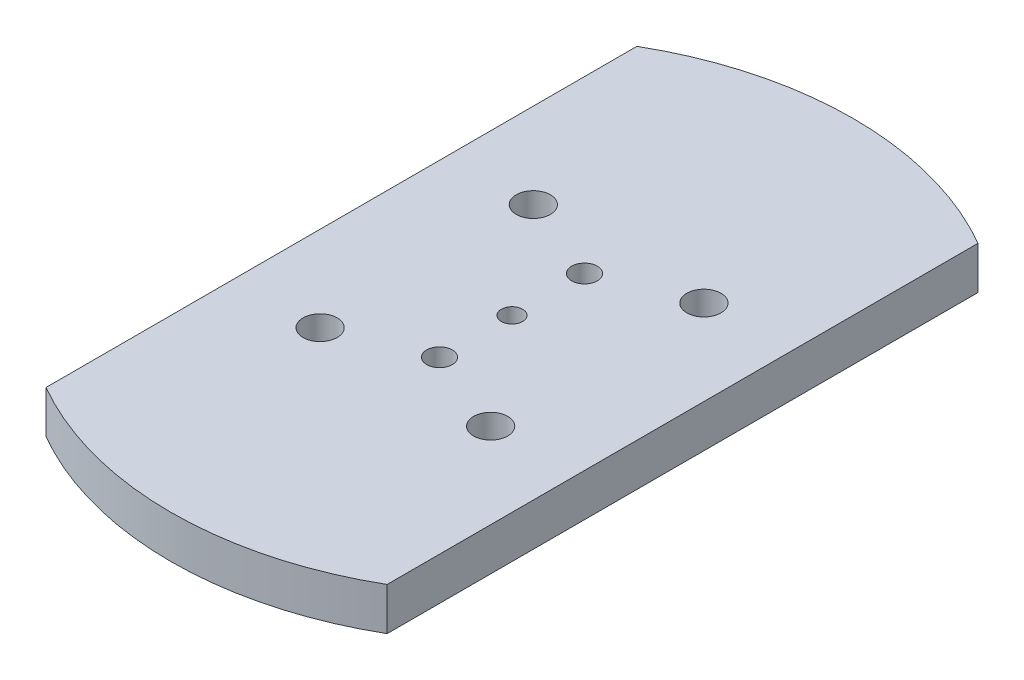
ISO-10303-21;
HEADER;
FILE_DESCRIPTION(('STEP AP214'),'2;1');
FILE_NAME('part.step','',(''),(''),'','','');
FILE_SCHEMA(('AUTOMOTIVE_DESIGN { 1 0 10303 214 1 1 1 1 }'));
ENDSEC;
DATA;
#1=APPLICATION_CONTEXT('core data for automotive mechanical design processes');
#2=APPLICATION_PROTOCOL_DEFINITION('international standard','automotive_design',2000,#1);
#3=PRODUCT_CONTEXT('',#1,'mechanical');
#4=PRODUCT('Part','Part','',(#3));
#5=PRODUCT_RELATED_PRODUCT_CATEGORY('part','',(#4));
#6=PRODUCT_DEFINITION_FORMATION('','',#4);
#7=PRODUCT_DEFINITION_CONTEXT('part definition',#1,'design');
#8=PRODUCT_DEFINITION('design','',#6,#7);
#9=PRODUCT_DEFINITION_SHAPE('','',#8);
#10=(LENGTH_UNIT() NAMED_UNIT(*) SI_UNIT(.MILLI.,.METRE.));
#11=(NAMED_UNIT(*) PLANE_ANGLE_UNIT() SI_UNIT($,.RADIAN.));
#12=(NAMED_UNIT(*) SI_UNIT($,.STERADIAN.) SOLID_ANGLE_UNIT());
#13=UNCERTAINTY_MEASURE_WITH_UNIT(LENGTH_MEASURE(1.E-05),#10,'distance_accuracy_value','');
#14=(GEOMETRIC_REPRESENTATION_CONTEXT(3) GLOBAL_UNCERTAINTY_ASSIGNED_CONTEXT((#13)) GLOBAL_UNIT_ASSIGNED_CONTEXT((#10,
#11,#12)) REPRESENTATION_CONTEXT('',''));
#15=CARTESIAN_POINT('',(0.,0.,0.));
#16=DIRECTION('',(0.,0.,1.));
#17=DIRECTION('',(1.,0.,0.));
#18=AXIS2_PLACEMENT_3D('',#15,#16,#17);
#19=CARTESIAN_POINT('',(0.,5.,0.));
#20=DIRECTION('',(0.,1.,0.));
#21=DIRECTION('',(0.,0.,1.));
#22=AXIS2_PLACEMENT_3D('',#19,#20,#21);
#23=PLANE('',#22);
#24=CARTESIAN_POINT('',(0.,5.,0.));
#25=DIRECTION('',(0.,1.,0.));
#26=DIRECTION('',(0.,0.,1.));
#27=AXIS2_PLACEMENT_3D('',#24,#25,#26);
#28=CIRCLE('',#27,1.25);
#29=CARTESIAN_POINT('',(0.,5.,1.25));
#30=VERTEX_POINT('',#29);
#31=EDGE_CURVE('E143',#30,#30,#28,.T.);
#32=ORIENTED_EDGE('',*,*,#31,.F.);
#33=EDGE_LOOP('',(#32));
#34=FACE_BOUND('',#33,.T.);
#35=CARTESIAN_POINT('',(10.,5.,-12.5));
#36=DIRECTION('',(0.,-1.,0.));
#37=DIRECTION('',(0.,0.,1.));
#38=AXIS2_PLACEMENT_3D('',#35,#36,#37);
#39=CIRCLE('',#38,2.);
#40=CARTESIAN_POINT('',(10.,5.,-10.5));
#41=VERTEX_POINT('',#40);
#42=EDGE_CURVE('E126',#41,#41,#39,.T.);
#43=ORIENTED_EDGE('',*,*,#42,.T.);
#44=EDGE_LOOP('',(#43));
#45=FACE_BOUND('',#44,.T.);
#46=CARTESIAN_POINT('',(-10.,5.,-12.5));
#47=DIRECTION('',(0.,1.,0.));
#48=DIRECTION('',(0.,0.,1.));
#49=AXIS2_PLACEMENT_3D('',#46,#47,#48);
#50=CIRCLE('',#49,2.);
#51=CARTESIAN_POINT('',(-10.,5.,-10.5));
#52=VERTEX_POINT('',#51);
#53=EDGE_CURVE('E119',#52,#52,#50,.T.);
#54=ORIENTED_EDGE('',*,*,#53,.F.);
#55=EDGE_LOOP('',(#54));
#56=FACE_BOUND('',#55,.T.);
#57=CARTESIAN_POINT('',(0.,5.,8.5));
#58=DIRECTION('',(0.,1.,0.));
#59=DIRECTION('',(0.,0.,1.));
#60=AXIS2_PLACEMENT_3D('',#57,#58,#59);
#61=CIRCLE('',#60,1.5);
#62=CARTESIAN_POINT('',(0.,5.,10.));
#63=VERTEX_POINT('',#62);
#64=EDGE_CURVE('E109',#63,#63,#61,.T.);
#65=ORIENTED_EDGE('',*,*,#64,.F.);
#66=EDGE_LOOP('',(#65));
#67=FACE_BOUND('',#66,.T.);
#68=CARTESIAN_POINT('',(0.,5.,-8.5));
#69=DIRECTION('',(0.,1.,0.));
#70=DIRECTION('',(0.,0.,1.));
#71=AXIS2_PLACEMENT_3D('',#68,#69,#70);
#72=CIRCLE('',#71,1.5);
#73=CARTESIAN_POINT('',(0.,5.,-7.));
#74=VERTEX_POINT('',#73);
#75=EDGE_CURVE('E103',#74,#74,#72,.T.);
#76=ORIENTED_EDGE('',*,*,#75,.F.);
#77=EDGE_LOOP('',(#76));
#78=FACE_BOUND('',#77,.T.);
#79=DIRECTION('',(0.,0.,-1.));
#80=VECTOR('',#79,1.);
#81=CARTESIAN_POINT('',(20.,5.,-40.));
#82=LINE('',#81,#80);
#83=CARTESIAN_POINT('',(20.,5.,34.6410161513775));
#84=VERTEX_POINT('',#83);
#85=CARTESIAN_POINT('',(20.,5.,-34.6410161513776));
#86=VERTEX_POINT('',#85);
#87=EDGE_CURVE('E95',#84,#86,#82,.T.);
#88=ORIENTED_EDGE('',*,*,#87,.T.);
#89=CARTESIAN_POINT('',(0.,5.,0.));
#90=DIRECTION('',(0.,1.,0.));
#91=DIRECTION('',(0.,0.,1.));
#92=AXIS2_PLACEMENT_3D('',#89,#90,#91);
#93=CIRCLE('',#92,40.);
#94=CARTESIAN_POINT('',(-20.,5.,-34.6410161513775));
#95=VERTEX_POINT('',#94);
#96=EDGE_CURVE('E57',#86,#95,#93,.T.);
#97=ORIENTED_EDGE('',*,*,#96,.T.);
#98=DIRECTION('',(0.,0.,1.));
#99=VECTOR('',#98,1.);
#100=CARTESIAN_POINT('',(-20.,5.,-40.));
#101=LINE('',#100,#99);
#102=CARTESIAN_POINT('',(-20.,5.,34.6410161513775));
#103=VERTEX_POINT('',#102);
#104=EDGE_CURVE('E92',#95,#103,#101,.T.);
#105=ORIENTED_EDGE('',*,*,#104,.T.);
#106=EDGE_CURVE('E117',#103,#84,#93,.T.);
#107=ORIENTED_EDGE('',*,*,#106,.T.);
#108=EDGE_LOOP('',(#88,#97,#105,#107));
#109=FACE_BOUND('',#108,.T.);
#110=CARTESIAN_POINT('',(10.,5.,12.5));
#111=DIRECTION('',(0.,1.,0.));
#112=DIRECTION('',(0.,0.,-1.));
#113=AXIS2_PLACEMENT_3D('',#110,#111,#112);
#114=CIRCLE('',#113,2.);
#115=CARTESIAN_POINT('',(10.,5.,10.5));
#116=VERTEX_POINT('',#115);
#117=EDGE_CURVE('E132',#116,#116,#114,.T.);
#118=ORIENTED_EDGE('',*,*,#117,.F.);
#119=EDGE_LOOP('',(#118));
#120=FACE_BOUND('',#119,.T.);
#121=CARTESIAN_POINT('',(-10.,5.,12.5));
#122=DIRECTION('',(0.,-1.,0.));
#123=DIRECTION('',(0.,0.,-1.));
#124=AXIS2_PLACEMENT_3D('',#121,#122,#123);
#125=CIRCLE('',#124,2.);
#126=CARTESIAN_POINT('',(-10.,5.,10.5));
#127=VERTEX_POINT('',#126);
#128=EDGE_CURVE('E138',#127,#127,#125,.T.);
#129=ORIENTED_EDGE('',*,*,#128,.T.);
#130=EDGE_LOOP('',(#129));
#131=FACE_BOUND('',#130,.T.);
#132=ADVANCED_FACE('F33',(#34,#45,#56,#67,#78,#109,#120,#131),#23,.T.);
#133=CARTESIAN_POINT('',(0.,0.,0.));
#134=DIRECTION('',(0.,1.,0.));
#135=DIRECTION('',(0.,0.,1.));
#136=AXIS2_PLACEMENT_3D('',#133,#134,#135);
#137=PLANE('',#136);
#138=CARTESIAN_POINT('',(0.,0.,0.));
#139=DIRECTION('',(0.,1.,0.));
#140=DIRECTION('',(0.,0.,1.));
#141=AXIS2_PLACEMENT_3D('',#138,#139,#140);
#142=CIRCLE('',#141,1.25);
#143=CARTESIAN_POINT('',(0.,0.,1.25));
#144=VERTEX_POINT('',#143);
#145=EDGE_CURVE('E37',#144,#144,#142,.T.);
#146=ORIENTED_EDGE('',*,*,#145,.T.);
#147=EDGE_LOOP('',(#146));
#148=FACE_BOUND('',#147,.T.);
#149=CARTESIAN_POINT('',(10.,0.,-12.5));
#150=DIRECTION('',(0.,-1.,0.));
#151=DIRECTION('',(0.,0.,1.));
#152=AXIS2_PLACEMENT_3D('',#149,#150,#151);
#153=CIRCLE('',#152,2.);
#154=CARTESIAN_POINT('',(10.,0.,-10.5));
#155=VERTEX_POINT('',#154);
#156=EDGE_CURVE('E123',#155,#155,#153,.T.);
#157=ORIENTED_EDGE('',*,*,#156,.F.);
#158=EDGE_LOOP('',(#157));
#159=FACE_BOUND('',#158,.T.);
#160=CARTESIAN_POINT('',(-10.,0.,-12.5));
#161=DIRECTION('',(0.,1.,0.));
#162=DIRECTION('',(0.,0.,1.));
#163=AXIS2_PLACEMENT_3D('',#160,#161,#162);
#164=CIRCLE('',#163,2.);
#165=CARTESIAN_POINT('',(-10.,0.,-10.5));
#166=VERTEX_POINT('',#165);
#167=EDGE_CURVE('E122',#166,#166,#164,.T.);
#168=ORIENTED_EDGE('',*,*,#167,.T.);
#169=EDGE_LOOP('',(#168));
#170=FACE_BOUND('',#169,.T.);
#171=CARTESIAN_POINT('',(0.,0.,8.5));
#172=DIRECTION('',(0.,1.,0.));
#173=DIRECTION('',(0.,0.,1.));
#174=AXIS2_PLACEMENT_3D('',#171,#172,#173);
#175=CIRCLE('',#174,1.5);
#176=CARTESIAN_POINT('',(0.,0.,10.));
#177=VERTEX_POINT('',#176);
#178=EDGE_CURVE('E106',#177,#177,#175,.T.);
#179=ORIENTED_EDGE('',*,*,#178,.T.);
#180=EDGE_LOOP('',(#179));
#181=FACE_BOUND('',#180,.T.);
#182=CARTESIAN_POINT('',(0.,0.,-8.5));
#183=DIRECTION('',(0.,1.,0.));
#184=DIRECTION('',(0.,0.,1.));
#185=AXIS2_PLACEMENT_3D('',#182,#183,#184);
#186=CIRCLE('',#185,1.5);
#187=CARTESIAN_POINT('',(0.,0.,-7.));
#188=VERTEX_POINT('',#187);
#189=EDGE_CURVE('E97',#188,#188,#186,.T.);
#190=ORIENTED_EDGE('',*,*,#189,.T.);
#191=EDGE_LOOP('',(#190));
#192=FACE_BOUND('',#191,.T.);
#193=CARTESIAN_POINT('',(0.,0.,0.));
#194=DIRECTION('',(0.,1.,0.));
#195=DIRECTION('',(0.,0.,1.));
#196=AXIS2_PLACEMENT_3D('',#193,#194,#195);
#197=CIRCLE('',#196,40.);
#198=CARTESIAN_POINT('',(20.,0.,-34.6410161513776));
#199=VERTEX_POINT('',#198);
#200=CARTESIAN_POINT('',(-20.,0.,-34.6410161513775));
#201=VERTEX_POINT('',#200);
#202=EDGE_CURVE('E12',#199,#201,#197,.T.);
#203=ORIENTED_EDGE('',*,*,#202,.F.);
#204=DIRECTION('',(0.,0.,-1.));
#205=VECTOR('',#204,1.);
#206=CARTESIAN_POINT('',(20.,0.,-40.));
#207=LINE('',#206,#205);
#208=CARTESIAN_POINT('',(20.,0.,34.6410161513775));
#209=VERTEX_POINT('',#208);
#210=EDGE_CURVE('E78',#209,#199,#207,.T.);
#211=ORIENTED_EDGE('',*,*,#210,.F.);
#212=CARTESIAN_POINT('',(-20.,0.,34.6410161513775));
#213=VERTEX_POINT('',#212);
#214=EDGE_CURVE('E42',#213,#209,#197,.T.);
#215=ORIENTED_EDGE('',*,*,#214,.F.);
#216=DIRECTION('',(0.,0.,1.));
#217=VECTOR('',#216,1.);
#218=CARTESIAN_POINT('',(-20.,0.,-40.));
#219=LINE('',#218,#217);
#220=EDGE_CURVE('E80',#201,#213,#219,.T.);
#221=ORIENTED_EDGE('',*,*,#220,.F.);
#222=EDGE_LOOP('',(#203,#211,#215,#221));
#223=FACE_BOUND('',#222,.T.);
#224=CARTESIAN_POINT('',(10.,0.,12.5));
#225=DIRECTION('',(0.,1.,0.));
#226=DIRECTION('',(0.,0.,-1.));
#227=AXIS2_PLACEMENT_3D('',#224,#225,#226);
#228=CIRCLE('',#227,2.);
#229=CARTESIAN_POINT('',(10.,0.,10.5));
#230=VERTEX_POINT('',#229);
#231=EDGE_CURVE('E129',#230,#230,#228,.T.);
#232=ORIENTED_EDGE('',*,*,#231,.T.);
#233=EDGE_LOOP('',(#232));
#234=FACE_BOUND('',#233,.T.);
#235=CARTESIAN_POINT('',(-10.,0.,12.5));
#236=DIRECTION('',(0.,-1.,0.));
#237=DIRECTION('',(0.,0.,-1.));
#238=AXIS2_PLACEMENT_3D('',#235,#236,#237);
#239=CIRCLE('',#238,2.);
#240=CARTESIAN_POINT('',(-10.,0.,10.5));
#241=VERTEX_POINT('',#240);
#242=EDGE_CURVE('E135',#241,#241,#239,.T.);
#243=ORIENTED_EDGE('',*,*,#242,.F.);
#244=EDGE_LOOP('',(#243));
#245=FACE_BOUND('',#244,.T.);
#246=ADVANCED_FACE('F75',(#148,#159,#170,#181,#192,#223,#234,#245),#137,.F.);
#247=CARTESIAN_POINT('',(-20.,5.,-40.));
#248=DIRECTION('',(1.,0.,0.));
#249=DIRECTION('',(0.,0.,-1.));
#250=AXIS2_PLACEMENT_3D('',#247,#248,#249);
#251=PLANE('',#250);
#252=DIRECTION('',(0.,-1.,0.));
#253=VECTOR('',#252,1.);
#254=CARTESIAN_POINT('',(-20.,10.,34.6410161513775));
#255=LINE('',#254,#253);
#256=EDGE_CURVE('E49',#103,#213,#255,.T.);
#257=ORIENTED_EDGE('',*,*,#256,.F.);
#258=ORIENTED_EDGE('',*,*,#104,.F.);
#259=DIRECTION('',(0.,-1.,0.));
#260=VECTOR('',#259,1.);
#261=CARTESIAN_POINT('',(-20.,10.,-34.6410161513775));
#262=LINE('',#261,#260);
#263=EDGE_CURVE('E87',#201,#95,#262,.F.);
#264=ORIENTED_EDGE('',*,*,#263,.F.);
#265=ORIENTED_EDGE('',*,*,#220,.T.);
#266=EDGE_LOOP('',(#257,#258,#264,#265));
#267=FACE_BOUND('',#266,.T.);
#268=ADVANCED_FACE('F35',(#267),#251,.F.);
#269=CARTESIAN_POINT('',(20.,5.,-40.));
#270=DIRECTION('',(-1.,0.,0.));
#271=DIRECTION('',(0.,0.,1.));
#272=AXIS2_PLACEMENT_3D('',#269,#270,#271);
#273=PLANE('',#272);
#274=DIRECTION('',(0.,-1.,0.));
#275=VECTOR('',#274,1.);
#276=CARTESIAN_POINT('',(20.,10.,-34.6410161513776));
#277=LINE('',#276,#275);
#278=EDGE_CURVE('E82',#86,#199,#277,.T.);
#279=ORIENTED_EDGE('',*,*,#278,.F.);
#280=ORIENTED_EDGE('',*,*,#87,.F.);
#281=DIRECTION('',(0.,-1.,0.));
#282=VECTOR('',#281,1.);
#283=CARTESIAN_POINT('',(20.,10.,34.6410161513775));
#284=LINE('',#283,#282);
#285=EDGE_CURVE('E91',#209,#84,#284,.F.);
#286=ORIENTED_EDGE('',*,*,#285,.F.);
#287=ORIENTED_EDGE('',*,*,#210,.T.);
#288=EDGE_LOOP('',(#279,#280,#286,#287));
#289=FACE_BOUND('',#288,.T.);
#290=ADVANCED_FACE('F90',(#289),#273,.F.);
#291=CARTESIAN_POINT('',(0.,0.,-8.5));
#292=DIRECTION('',(0.,1.,0.));
#293=DIRECTION('',(0.,0.,1.));
#294=AXIS2_PLACEMENT_3D('',#291,#292,#293);
#295=CYLINDRICAL_SURFACE('',#294,1.5);
#296=ORIENTED_EDGE('',*,*,#189,.F.);
#297=EDGE_LOOP('',(#296));
#298=FACE_BOUND('',#297,.T.);
#299=ORIENTED_EDGE('',*,*,#75,.T.);
#300=EDGE_LOOP('',(#299));
#301=FACE_BOUND('',#300,.T.);
#302=ADVANCED_FACE('F171',(#298,#301),#295,.F.);
#303=CARTESIAN_POINT('',(0.,0.,8.5));
#304=DIRECTION('',(0.,1.,0.));
#305=DIRECTION('',(0.,0.,1.));
#306=AXIS2_PLACEMENT_3D('',#303,#304,#305);
#307=CYLINDRICAL_SURFACE('',#306,1.5);
#308=ORIENTED_EDGE('',*,*,#178,.F.);
#309=EDGE_LOOP('',(#308));
#310=FACE_BOUND('',#309,.T.);
#311=ORIENTED_EDGE('',*,*,#64,.T.);
#312=EDGE_LOOP('',(#311));
#313=FACE_BOUND('',#312,.T.);
#314=ADVANCED_FACE('F178',(#310,#313),#307,.F.);
#315=CARTESIAN_POINT('',(0.,10.,0.));
#316=DIRECTION('',(0.,-1.,0.));
#317=DIRECTION('',(0.,0.,-1.));
#318=AXIS2_PLACEMENT_3D('',#315,#316,#317);
#319=CYLINDRICAL_SURFACE('',#318,40.);
#320=ORIENTED_EDGE('',*,*,#106,.F.);
#321=ORIENTED_EDGE('',*,*,#256,.T.);
#322=ORIENTED_EDGE('',*,*,#214,.T.);
#323=ORIENTED_EDGE('',*,*,#285,.T.);
#324=EDGE_LOOP('',(#320,#321,#322,#323));
#325=FACE_BOUND('',#324,.T.);
#326=ADVANCED_FACE('F185',(#325),#319,.T.);
#327=ORIENTED_EDGE('',*,*,#96,.F.);
#328=ORIENTED_EDGE('',*,*,#278,.T.);
#329=ORIENTED_EDGE('',*,*,#202,.T.);
#330=ORIENTED_EDGE('',*,*,#263,.T.);
#331=EDGE_LOOP('',(#327,#328,#329,#330));
#332=FACE_BOUND('',#331,.T.);
#333=ADVANCED_FACE('F83',(#332),#319,.T.);
#334=CARTESIAN_POINT('',(-10.,0.,-12.5));
#335=DIRECTION('',(0.,1.,0.));
#336=DIRECTION('',(0.,0.,1.));
#337=AXIS2_PLACEMENT_3D('',#334,#335,#336);
#338=CYLINDRICAL_SURFACE('',#337,2.);
#339=ORIENTED_EDGE('',*,*,#167,.F.);
#340=EDGE_LOOP('',(#339));
#341=FACE_BOUND('',#340,.T.);
#342=ORIENTED_EDGE('',*,*,#53,.T.);
#343=EDGE_LOOP('',(#342));
#344=FACE_BOUND('',#343,.T.);
#345=ADVANCED_FACE('F192',(#341,#344),#338,.F.);
#346=CARTESIAN_POINT('',(10.,0.,-12.5));
#347=DIRECTION('',(0.,1.,0.));
#348=DIRECTION('',(0.,0.,1.));
#349=AXIS2_PLACEMENT_3D('',#346,#347,#348);
#350=CYLINDRICAL_SURFACE('',#349,2.);
#351=ORIENTED_EDGE('',*,*,#156,.T.);
#352=EDGE_LOOP('',(#351));
#353=FACE_BOUND('',#352,.T.);
#354=ORIENTED_EDGE('',*,*,#42,.F.);
#355=EDGE_LOOP('',(#354));
#356=FACE_BOUND('',#355,.T.);
#357=ADVANCED_FACE('F197',(#353,#356),#350,.F.);
#358=CARTESIAN_POINT('',(10.,0.,12.5));
#359=DIRECTION('',(0.,1.,0.));
#360=DIRECTION('',(0.,0.,1.));
#361=AXIS2_PLACEMENT_3D('',#358,#359,#360);
#362=CYLINDRICAL_SURFACE('',#361,2.);
#363=ORIENTED_EDGE('',*,*,#231,.F.);
#364=EDGE_LOOP('',(#363));
#365=FACE_BOUND('',#364,.T.);
#366=ORIENTED_EDGE('',*,*,#117,.T.);
#367=EDGE_LOOP('',(#366));
#368=FACE_BOUND('',#367,.T.);
#369=ADVANCED_FACE('F159',(#365,#368),#362,.F.);
#370=CARTESIAN_POINT('',(-10.,0.,12.5));
#371=DIRECTION('',(0.,1.,0.));
#372=DIRECTION('',(0.,0.,1.));
#373=AXIS2_PLACEMENT_3D('',#370,#371,#372);
#374=CYLINDRICAL_SURFACE('',#373,2.);
#375=ORIENTED_EDGE('',*,*,#242,.T.);
#376=EDGE_LOOP('',(#375));
#377=FACE_BOUND('',#376,.T.);
#378=ORIENTED_EDGE('',*,*,#128,.F.);
#379=EDGE_LOOP('',(#378));
#380=FACE_BOUND('',#379,.T.);
#381=ADVANCED_FACE('F154',(#377,#380),#374,.F.);
#382=CARTESIAN_POINT('',(0.,-5.,0.));
#383=DIRECTION('',(0.,1.,0.));
#384=DIRECTION('',(0.,0.,1.));
#385=AXIS2_PLACEMENT_3D('',#382,#383,#384);
#386=CYLINDRICAL_SURFACE('',#385,1.25);
#387=ORIENTED_EDGE('',*,*,#31,.T.);
#388=EDGE_LOOP('',(#387));
#389=FACE_BOUND('',#388,.T.);
#390=ORIENTED_EDGE('',*,*,#145,.F.);
#391=EDGE_LOOP('',(#390));
#392=FACE_BOUND('',#391,.T.);
#393=ADVANCED_FACE('F152',(#389,#392),#386,.F.);
#394=CLOSED_SHELL('',(#132,#246,#268,#290,#302,#314,#326,#333,#345,#357,#369,#381,#393));
#395=MANIFOLD_SOLID_BREP('B2',#394);
#396=ADVANCED_BREP_SHAPE_REPRESENTATION('',(#18,#395),#14);
#397=SHAPE_DEFINITION_REPRESENTATION(#9,#396);
ENDSEC;
END-ISO-10303-21;
